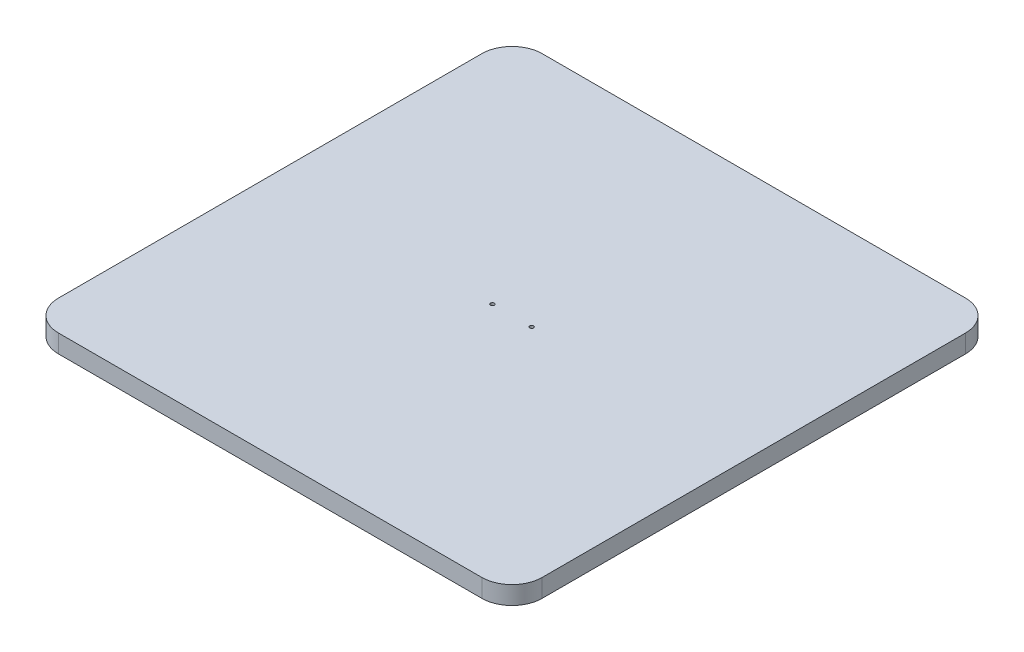
ISO-10303-21;
HEADER;
FILE_DESCRIPTION(('STEP AP214'),'2;1');
FILE_NAME('part.step','',(''),(''),'','','');
FILE_SCHEMA(('AUTOMOTIVE_DESIGN { 1 0 10303 214 1 1 1 1 }'));
ENDSEC;
DATA;
#1=APPLICATION_CONTEXT('core data for automotive mechanical design processes');
#2=APPLICATION_PROTOCOL_DEFINITION('international standard','automotive_design',2000,#1);
#3=PRODUCT_CONTEXT('',#1,'mechanical');
#4=PRODUCT('Part','Part','',(#3));
#5=PRODUCT_RELATED_PRODUCT_CATEGORY('part','',(#4));
#6=PRODUCT_DEFINITION_FORMATION('','',#4);
#7=PRODUCT_DEFINITION_CONTEXT('part definition',#1,'design');
#8=PRODUCT_DEFINITION('design','',#6,#7);
#9=PRODUCT_DEFINITION_SHAPE('','',#8);
#10=(LENGTH_UNIT() NAMED_UNIT(*) SI_UNIT(.MILLI.,.METRE.));
#11=(NAMED_UNIT(*) PLANE_ANGLE_UNIT() SI_UNIT($,.RADIAN.));
#12=(NAMED_UNIT(*) SI_UNIT($,.STERADIAN.) SOLID_ANGLE_UNIT());
#13=UNCERTAINTY_MEASURE_WITH_UNIT(LENGTH_MEASURE(1.E-05),#10,'distance_accuracy_value','');
#14=(GEOMETRIC_REPRESENTATION_CONTEXT(3) GLOBAL_UNCERTAINTY_ASSIGNED_CONTEXT((#13)) GLOBAL_UNIT_ASSIGNED_CONTEXT((#10,
#11,#12)) REPRESENTATION_CONTEXT('',''));
#15=CARTESIAN_POINT('',(0.,0.,0.));
#16=DIRECTION('',(0.,0.,1.));
#17=DIRECTION('',(1.,0.,0.));
#18=AXIS2_PLACEMENT_3D('',#15,#16,#17);
#19=CARTESIAN_POINT('',(-80.,6.,-80.));
#20=DIRECTION('',(1.,0.,0.));
#21=DIRECTION('',(0.,0.,-1.));
#22=AXIS2_PLACEMENT_3D('',#19,#20,#21);
#23=PLANE('',#22);
#24=DIRECTION('',(0.,0.,1.));
#25=VECTOR('',#24,1.);
#26=CARTESIAN_POINT('',(-80.,0.,-80.));
#27=LINE('',#26,#25);
#28=CARTESIAN_POINT('',(-80.,0.,-70.));
#29=VERTEX_POINT('',#28);
#30=CARTESIAN_POINT('',(-80.,0.,70.));
#31=VERTEX_POINT('',#30);
#32=EDGE_CURVE('E133',#29,#31,#27,.T.);
#33=ORIENTED_EDGE('',*,*,#32,.T.);
#34=DIRECTION('',(0.,-1.,0.));
#35=VECTOR('',#34,1.);
#36=CARTESIAN_POINT('',(-80.,6.,70.));
#37=LINE('',#36,#35);
#38=CARTESIAN_POINT('',(-80.,6.,70.));
#39=VERTEX_POINT('',#38);
#40=EDGE_CURVE('E111',#31,#39,#37,.F.);
#41=ORIENTED_EDGE('',*,*,#40,.T.);
#42=DIRECTION('',(0.,0.,1.));
#43=VECTOR('',#42,1.);
#44=CARTESIAN_POINT('',(-80.,6.,-80.));
#45=LINE('',#44,#43);
#46=CARTESIAN_POINT('',(-80.,6.,-70.));
#47=VERTEX_POINT('',#46);
#48=EDGE_CURVE('E143',#47,#39,#45,.T.);
#49=ORIENTED_EDGE('',*,*,#48,.F.);
#50=DIRECTION('',(0.,-1.,0.));
#51=VECTOR('',#50,1.);
#52=CARTESIAN_POINT('',(-80.,6.,-70.));
#53=LINE('',#52,#51);
#54=EDGE_CURVE('E116',#47,#29,#53,.T.);
#55=ORIENTED_EDGE('',*,*,#54,.T.);
#56=EDGE_LOOP('',(#33,#41,#49,#55));
#57=FACE_BOUND('',#56,.T.);
#58=ADVANCED_FACE('F40',(#57),#23,.F.);
#59=CARTESIAN_POINT('',(80.,6.,80.));
#60=DIRECTION('',(0.,0.,-1.));
#61=DIRECTION('',(-1.,0.,0.));
#62=AXIS2_PLACEMENT_3D('',#59,#60,#61);
#63=PLANE('',#62);
#64=DIRECTION('',(1.,0.,0.));
#65=VECTOR('',#64,1.);
#66=CARTESIAN_POINT('',(80.,6.,80.));
#67=LINE('',#66,#65);
#68=CARTESIAN_POINT('',(-70.,6.,80.));
#69=VERTEX_POINT('',#68);
#70=CARTESIAN_POINT('',(70.,6.,80.));
#71=VERTEX_POINT('',#70);
#72=EDGE_CURVE('E126',#69,#71,#67,.T.);
#73=ORIENTED_EDGE('',*,*,#72,.F.);
#74=DIRECTION('',(0.,-1.,0.));
#75=VECTOR('',#74,1.);
#76=CARTESIAN_POINT('',(-70.,6.,80.));
#77=LINE('',#76,#75);
#78=CARTESIAN_POINT('',(-70.,0.,80.));
#79=VERTEX_POINT('',#78);
#80=EDGE_CURVE('E110',#69,#79,#77,.T.);
#81=ORIENTED_EDGE('',*,*,#80,.T.);
#82=DIRECTION('',(1.,0.,0.));
#83=VECTOR('',#82,1.);
#84=CARTESIAN_POINT('',(80.,0.,80.));
#85=LINE('',#84,#83);
#86=CARTESIAN_POINT('',(70.,0.,80.));
#87=VERTEX_POINT('',#86);
#88=EDGE_CURVE('E123',#79,#87,#85,.T.);
#89=ORIENTED_EDGE('',*,*,#88,.T.);
#90=DIRECTION('',(0.,-1.,0.));
#91=VECTOR('',#90,1.);
#92=CARTESIAN_POINT('',(70.,6.,80.));
#93=LINE('',#92,#91);
#94=EDGE_CURVE('E128',#87,#71,#93,.F.);
#95=ORIENTED_EDGE('',*,*,#94,.T.);
#96=EDGE_LOOP('',(#73,#81,#89,#95));
#97=FACE_BOUND('',#96,.T.);
#98=ADVANCED_FACE('F122',(#97),#63,.F.);
#99=CARTESIAN_POINT('',(80.,6.,-80.));
#100=DIRECTION('',(-1.,0.,0.));
#101=DIRECTION('',(0.,0.,1.));
#102=AXIS2_PLACEMENT_3D('',#99,#100,#101);
#103=PLANE('',#102);
#104=DIRECTION('',(0.,0.,-1.));
#105=VECTOR('',#104,1.);
#106=CARTESIAN_POINT('',(80.,6.,-80.));
#107=LINE('',#106,#105);
#108=CARTESIAN_POINT('',(80.,6.,70.));
#109=VERTEX_POINT('',#108);
#110=CARTESIAN_POINT('',(80.,6.,-70.));
#111=VERTEX_POINT('',#110);
#112=EDGE_CURVE('E169',#109,#111,#107,.T.);
#113=ORIENTED_EDGE('',*,*,#112,.F.);
#114=DIRECTION('',(0.,-1.,0.));
#115=VECTOR('',#114,1.);
#116=CARTESIAN_POINT('',(80.,6.,70.));
#117=LINE('',#116,#115);
#118=CARTESIAN_POINT('',(80.,0.,70.));
#119=VERTEX_POINT('',#118);
#120=EDGE_CURVE('E162',#109,#119,#117,.T.);
#121=ORIENTED_EDGE('',*,*,#120,.T.);
#122=DIRECTION('',(0.,0.,-1.));
#123=VECTOR('',#122,1.);
#124=CARTESIAN_POINT('',(80.,0.,-80.));
#125=LINE('',#124,#123);
#126=CARTESIAN_POINT('',(80.,0.,-70.));
#127=VERTEX_POINT('',#126);
#128=EDGE_CURVE('E132',#119,#127,#125,.T.);
#129=ORIENTED_EDGE('',*,*,#128,.T.);
#130=DIRECTION('',(0.,-1.,0.));
#131=VECTOR('',#130,1.);
#132=CARTESIAN_POINT('',(80.,6.,-70.));
#133=LINE('',#132,#131);
#134=EDGE_CURVE('E160',#127,#111,#133,.F.);
#135=ORIENTED_EDGE('',*,*,#134,.T.);
#136=EDGE_LOOP('',(#113,#121,#129,#135));
#137=FACE_BOUND('',#136,.T.);
#138=ADVANCED_FACE('F167',(#137),#103,.F.);
#139=CARTESIAN_POINT('',(80.,6.,-80.));
#140=DIRECTION('',(0.,0.,1.));
#141=DIRECTION('',(1.,0.,0.));
#142=AXIS2_PLACEMENT_3D('',#139,#140,#141);
#143=PLANE('',#142);
#144=DIRECTION('',(-1.,0.,0.));
#145=VECTOR('',#144,1.);
#146=CARTESIAN_POINT('',(80.,6.,-80.));
#147=LINE('',#146,#145);
#148=CARTESIAN_POINT('',(70.,6.,-80.));
#149=VERTEX_POINT('',#148);
#150=CARTESIAN_POINT('',(-70.,6.,-80.));
#151=VERTEX_POINT('',#150);
#152=EDGE_CURVE('E144',#149,#151,#147,.T.);
#153=ORIENTED_EDGE('',*,*,#152,.F.);
#154=DIRECTION('',(0.,-1.,0.));
#155=VECTOR('',#154,1.);
#156=CARTESIAN_POINT('',(70.,6.,-80.));
#157=LINE('',#156,#155);
#158=CARTESIAN_POINT('',(70.,0.,-80.));
#159=VERTEX_POINT('',#158);
#160=EDGE_CURVE('E11',#149,#159,#157,.T.);
#161=ORIENTED_EDGE('',*,*,#160,.T.);
#162=DIRECTION('',(-1.,0.,0.));
#163=VECTOR('',#162,1.);
#164=CARTESIAN_POINT('',(80.,0.,-80.));
#165=LINE('',#164,#163);
#166=CARTESIAN_POINT('',(-70.,0.,-80.));
#167=VERTEX_POINT('',#166);
#168=EDGE_CURVE('E136',#159,#167,#165,.T.);
#169=ORIENTED_EDGE('',*,*,#168,.T.);
#170=DIRECTION('',(0.,-1.,0.));
#171=VECTOR('',#170,1.);
#172=CARTESIAN_POINT('',(-70.,6.,-80.));
#173=LINE('',#172,#171);
#174=EDGE_CURVE('E48',#167,#151,#173,.F.);
#175=ORIENTED_EDGE('',*,*,#174,.T.);
#176=EDGE_LOOP('',(#153,#161,#169,#175));
#177=FACE_BOUND('',#176,.T.);
#178=ADVANCED_FACE('F176',(#177),#143,.F.);
#179=CARTESIAN_POINT('',(0.,6.,0.));
#180=DIRECTION('',(0.,-1.,0.));
#181=DIRECTION('',(0.,0.,-1.));
#182=AXIS2_PLACEMENT_3D('',#179,#180,#181);
#183=PLANE('',#182);
#184=CARTESIAN_POINT('',(-6.5,6.,0.));
#185=DIRECTION('',(0.,1.,0.));
#186=DIRECTION('',(0.,0.,1.));
#187=AXIS2_PLACEMENT_3D('',#184,#185,#186);
#188=CIRCLE('',#187,0.624999999999988);
#189=CARTESIAN_POINT('',(-6.5,6.,0.624999999999988));
#190=VERTEX_POINT('',#189);
#191=EDGE_CURVE('E191',#190,#190,#188,.T.);
#192=ORIENTED_EDGE('',*,*,#191,.F.);
#193=EDGE_LOOP('',(#192));
#194=FACE_BOUND('',#193,.T.);
#195=CARTESIAN_POINT('',(6.5,6.,0.));
#196=DIRECTION('',(0.,1.,0.));
#197=DIRECTION('',(0.,0.,1.));
#198=AXIS2_PLACEMENT_3D('',#195,#196,#197);
#199=CIRCLE('',#198,0.624999999999988);
#200=CARTESIAN_POINT('',(6.5,6.,0.624999999999988));
#201=VERTEX_POINT('',#200);
#202=EDGE_CURVE('E185',#201,#201,#199,.T.);
#203=ORIENTED_EDGE('',*,*,#202,.F.);
#204=EDGE_LOOP('',(#203));
#205=FACE_BOUND('',#204,.T.);
#206=ORIENTED_EDGE('',*,*,#48,.T.);
#207=CARTESIAN_POINT('',(-70.,6.,70.));
#208=DIRECTION('',(0.,-1.,0.));
#209=DIRECTION('',(0.,0.,-1.));
#210=AXIS2_PLACEMENT_3D('',#207,#208,#209);
#211=CIRCLE('',#210,10.);
#212=EDGE_CURVE('E158',#39,#69,#211,.F.);
#213=ORIENTED_EDGE('',*,*,#212,.T.);
#214=ORIENTED_EDGE('',*,*,#72,.T.);
#215=CARTESIAN_POINT('',(70.,6.,70.));
#216=DIRECTION('',(0.,-1.,0.));
#217=DIRECTION('',(0.,0.,-1.));
#218=AXIS2_PLACEMENT_3D('',#215,#216,#217);
#219=CIRCLE('',#218,10.);
#220=EDGE_CURVE('E156',#71,#109,#219,.F.);
#221=ORIENTED_EDGE('',*,*,#220,.T.);
#222=ORIENTED_EDGE('',*,*,#112,.T.);
#223=CARTESIAN_POINT('',(70.,6.,-70.));
#224=DIRECTION('',(0.,-1.,0.));
#225=DIRECTION('',(0.,0.,-1.));
#226=AXIS2_PLACEMENT_3D('',#223,#224,#225);
#227=CIRCLE('',#226,10.);
#228=EDGE_CURVE('E61',#111,#149,#227,.F.);
#229=ORIENTED_EDGE('',*,*,#228,.T.);
#230=ORIENTED_EDGE('',*,*,#152,.T.);
#231=CARTESIAN_POINT('',(-70.,6.,-70.));
#232=DIRECTION('',(0.,-1.,0.));
#233=DIRECTION('',(0.,0.,-1.));
#234=AXIS2_PLACEMENT_3D('',#231,#232,#233);
#235=CIRCLE('',#234,10.);
#236=EDGE_CURVE('E153',#151,#47,#235,.F.);
#237=ORIENTED_EDGE('',*,*,#236,.T.);
#238=EDGE_LOOP('',(#206,#213,#214,#221,#222,#229,#230,#237));
#239=FACE_BOUND('',#238,.T.);
#240=ADVANCED_FACE('F197',(#194,#205,#239),#183,.F.);
#241=CARTESIAN_POINT('',(0.,0.,0.));
#242=DIRECTION('',(0.,-1.,0.));
#243=DIRECTION('',(0.,0.,-1.));
#244=AXIS2_PLACEMENT_3D('',#241,#242,#243);
#245=PLANE('',#244);
#246=CARTESIAN_POINT('',(-6.5,0.,0.));
#247=DIRECTION('',(0.,1.,0.));
#248=DIRECTION('',(0.,0.,1.));
#249=AXIS2_PLACEMENT_3D('',#246,#247,#248);
#250=CIRCLE('',#249,0.624999999999998);
#251=CARTESIAN_POINT('',(-6.5,0.,0.624999999999998));
#252=VERTEX_POINT('',#251);
#253=EDGE_CURVE('E188',#252,#252,#250,.T.);
#254=ORIENTED_EDGE('',*,*,#253,.T.);
#255=EDGE_LOOP('',(#254));
#256=FACE_BOUND('',#255,.T.);
#257=CARTESIAN_POINT('',(6.5,0.,0.));
#258=DIRECTION('',(0.,1.,0.));
#259=DIRECTION('',(0.,0.,1.));
#260=AXIS2_PLACEMENT_3D('',#257,#258,#259);
#261=CIRCLE('',#260,0.624999999999998);
#262=CARTESIAN_POINT('',(6.5,0.,0.624999999999998));
#263=VERTEX_POINT('',#262);
#264=EDGE_CURVE('E138',#263,#263,#261,.T.);
#265=ORIENTED_EDGE('',*,*,#264,.T.);
#266=EDGE_LOOP('',(#265));
#267=FACE_BOUND('',#266,.T.);
#268=ORIENTED_EDGE('',*,*,#88,.F.);
#269=CARTESIAN_POINT('',(-70.,0.,70.));
#270=DIRECTION('',(0.,-1.,0.));
#271=DIRECTION('',(0.,0.,-1.));
#272=AXIS2_PLACEMENT_3D('',#269,#270,#271);
#273=CIRCLE('',#272,10.);
#274=EDGE_CURVE('E106',#79,#31,#273,.T.);
#275=ORIENTED_EDGE('',*,*,#274,.T.);
#276=ORIENTED_EDGE('',*,*,#32,.F.);
#277=CARTESIAN_POINT('',(-70.,0.,-70.));
#278=DIRECTION('',(0.,-1.,0.));
#279=DIRECTION('',(0.,0.,-1.));
#280=AXIS2_PLACEMENT_3D('',#277,#278,#279);
#281=CIRCLE('',#280,10.);
#282=EDGE_CURVE('E127',#29,#167,#281,.T.);
#283=ORIENTED_EDGE('',*,*,#282,.T.);
#284=ORIENTED_EDGE('',*,*,#168,.F.);
#285=CARTESIAN_POINT('',(70.,0.,-70.));
#286=DIRECTION('',(0.,-1.,0.));
#287=DIRECTION('',(0.,0.,-1.));
#288=AXIS2_PLACEMENT_3D('',#285,#286,#287);
#289=CIRCLE('',#288,10.);
#290=EDGE_CURVE('E147',#159,#127,#289,.T.);
#291=ORIENTED_EDGE('',*,*,#290,.T.);
#292=ORIENTED_EDGE('',*,*,#128,.F.);
#293=CARTESIAN_POINT('',(70.,0.,70.));
#294=DIRECTION('',(0.,-1.,0.));
#295=DIRECTION('',(0.,0.,-1.));
#296=AXIS2_PLACEMENT_3D('',#293,#294,#295);
#297=CIRCLE('',#296,10.);
#298=EDGE_CURVE('E117',#119,#87,#297,.T.);
#299=ORIENTED_EDGE('',*,*,#298,.T.);
#300=EDGE_LOOP('',(#268,#275,#276,#283,#284,#291,#292,#299));
#301=FACE_BOUND('',#300,.T.);
#302=ADVANCED_FACE('F130',(#256,#267,#301),#245,.T.);
#303=CARTESIAN_POINT('',(6.5,6.,0.));
#304=DIRECTION('',(0.,1.,0.));
#305=DIRECTION('',(0.,0.,1.));
#306=AXIS2_PLACEMENT_3D('',#303,#304,#305);
#307=CYLINDRICAL_SURFACE('',#306,0.624999999999993);
#308=ORIENTED_EDGE('',*,*,#264,.F.);
#309=EDGE_LOOP('',(#308));
#310=FACE_BOUND('',#309,.T.);
#311=ORIENTED_EDGE('',*,*,#202,.T.);
#312=EDGE_LOOP('',(#311));
#313=FACE_BOUND('',#312,.T.);
#314=ADVANCED_FACE('F256',(#310,#313),#307,.F.);
#315=CARTESIAN_POINT('',(-6.5,6.,0.));
#316=DIRECTION('',(0.,1.,0.));
#317=DIRECTION('',(0.,0.,1.));
#318=AXIS2_PLACEMENT_3D('',#315,#316,#317);
#319=CYLINDRICAL_SURFACE('',#318,0.624999999999993);
#320=ORIENTED_EDGE('',*,*,#253,.F.);
#321=EDGE_LOOP('',(#320));
#322=FACE_BOUND('',#321,.T.);
#323=ORIENTED_EDGE('',*,*,#191,.T.);
#324=EDGE_LOOP('',(#323));
#325=FACE_BOUND('',#324,.T.);
#326=ADVANCED_FACE('F195',(#322,#325),#319,.F.);
#327=CARTESIAN_POINT('',(-70.,6.,70.));
#328=DIRECTION('',(0.,-1.,0.));
#329=DIRECTION('',(0.,0.,-1.));
#330=AXIS2_PLACEMENT_3D('',#327,#328,#329);
#331=CYLINDRICAL_SURFACE('',#330,10.);
#332=ORIENTED_EDGE('',*,*,#212,.F.);
#333=ORIENTED_EDGE('',*,*,#40,.F.);
#334=ORIENTED_EDGE('',*,*,#274,.F.);
#335=ORIENTED_EDGE('',*,*,#80,.F.);
#336=EDGE_LOOP('',(#332,#333,#334,#335));
#337=FACE_BOUND('',#336,.T.);
#338=ADVANCED_FACE('F109',(#337),#331,.T.);
#339=CARTESIAN_POINT('',(70.,6.,70.));
#340=DIRECTION('',(0.,-1.,0.));
#341=DIRECTION('',(0.,0.,-1.));
#342=AXIS2_PLACEMENT_3D('',#339,#340,#341);
#343=CYLINDRICAL_SURFACE('',#342,10.);
#344=ORIENTED_EDGE('',*,*,#220,.F.);
#345=ORIENTED_EDGE('',*,*,#94,.F.);
#346=ORIENTED_EDGE('',*,*,#298,.F.);
#347=ORIENTED_EDGE('',*,*,#120,.F.);
#348=EDGE_LOOP('',(#344,#345,#346,#347));
#349=FACE_BOUND('',#348,.T.);
#350=ADVANCED_FACE('F210',(#349),#343,.T.);
#351=CARTESIAN_POINT('',(70.,6.,-70.));
#352=DIRECTION('',(0.,-1.,0.));
#353=DIRECTION('',(0.,0.,-1.));
#354=AXIS2_PLACEMENT_3D('',#351,#352,#353);
#355=CYLINDRICAL_SURFACE('',#354,10.);
#356=ORIENTED_EDGE('',*,*,#228,.F.);
#357=ORIENTED_EDGE('',*,*,#134,.F.);
#358=ORIENTED_EDGE('',*,*,#290,.F.);
#359=ORIENTED_EDGE('',*,*,#160,.F.);
#360=EDGE_LOOP('',(#356,#357,#358,#359));
#361=FACE_BOUND('',#360,.T.);
#362=ADVANCED_FACE('F175',(#361),#355,.T.);
#363=CARTESIAN_POINT('',(-70.,6.,-70.));
#364=DIRECTION('',(0.,-1.,0.));
#365=DIRECTION('',(0.,0.,-1.));
#366=AXIS2_PLACEMENT_3D('',#363,#364,#365);
#367=CYLINDRICAL_SURFACE('',#366,10.);
#368=ORIENTED_EDGE('',*,*,#236,.F.);
#369=ORIENTED_EDGE('',*,*,#174,.F.);
#370=ORIENTED_EDGE('',*,*,#282,.F.);
#371=ORIENTED_EDGE('',*,*,#54,.F.);
#372=EDGE_LOOP('',(#368,#369,#370,#371));
#373=FACE_BOUND('',#372,.T.);
#374=ADVANCED_FACE('F42',(#373),#367,.T.);
#375=CLOSED_SHELL('',(#58,#98,#138,#178,#240,#302,#314,#326,#338,#350,#362,#374));
#376=MANIFOLD_SOLID_BREP('B2',#375);
#377=ADVANCED_BREP_SHAPE_REPRESENTATION('',(#18,#376),#14);
#378=SHAPE_DEFINITION_REPRESENTATION(#9,#377);
ENDSEC;
END-ISO-10303-21;
